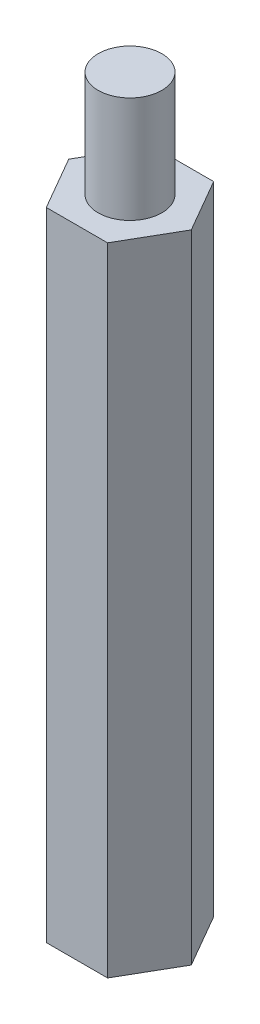
ISO-10303-21;
HEADER;
FILE_DESCRIPTION(('STEP AP214'),'2;1');
FILE_NAME('part.step','',(''),(''),'','','');
FILE_SCHEMA(('AUTOMOTIVE_DESIGN { 1 0 10303 214 1 1 1 1 }'));
ENDSEC;
DATA;
#1=APPLICATION_CONTEXT('core data for automotive mechanical design processes');
#2=APPLICATION_PROTOCOL_DEFINITION('international standard','automotive_design',2000,#1);
#3=PRODUCT_CONTEXT('',#1,'mechanical');
#4=PRODUCT('Part','Part','',(#3));
#5=PRODUCT_RELATED_PRODUCT_CATEGORY('part','',(#4));
#6=PRODUCT_DEFINITION_FORMATION('','',#4);
#7=PRODUCT_DEFINITION_CONTEXT('part definition',#1,'design');
#8=PRODUCT_DEFINITION('design','',#6,#7);
#9=PRODUCT_DEFINITION_SHAPE('','',#8);
#10=(LENGTH_UNIT() NAMED_UNIT(*) SI_UNIT(.MILLI.,.METRE.));
#11=(NAMED_UNIT(*) PLANE_ANGLE_UNIT() SI_UNIT($,.RADIAN.));
#12=(NAMED_UNIT(*) SI_UNIT($,.STERADIAN.) SOLID_ANGLE_UNIT());
#13=UNCERTAINTY_MEASURE_WITH_UNIT(LENGTH_MEASURE(1.E-05),#10,'distance_accuracy_value','');
#14=(GEOMETRIC_REPRESENTATION_CONTEXT(3) GLOBAL_UNCERTAINTY_ASSIGNED_CONTEXT((#13)) GLOBAL_UNIT_ASSIGNED_CONTEXT((#10,
#11,#12)) REPRESENTATION_CONTEXT('',''));
#15=CARTESIAN_POINT('',(0.,0.,0.));
#16=DIRECTION('',(0.,0.,1.));
#17=DIRECTION('',(1.,0.,0.));
#18=AXIS2_PLACEMENT_3D('',#15,#16,#17);
#19=CARTESIAN_POINT('',(1.44337567297409,30.,2.49999999999997));
#20=DIRECTION('',(-0.866025403784442,0.,-0.499999999999995));
#21=DIRECTION('',(-0.499999999999995,0.,0.866025403784442));
#22=AXIS2_PLACEMENT_3D('',#19,#20,#21);
#23=PLANE('',#22);
#24=DIRECTION('',(0.499999999999995,0.,-0.866025403784442));
#25=VECTOR('',#24,1.);
#26=CARTESIAN_POINT('',(1.44337567297409,0.,2.49999999999997));
#27=LINE('',#26,#25);
#28=CARTESIAN_POINT('',(1.44337567297409,0.,2.49999999999997));
#29=VERTEX_POINT('',#28);
#30=CARTESIAN_POINT('',(2.88675134594812,0.,0.));
#31=VERTEX_POINT('',#30);
#32=EDGE_CURVE('E118',#29,#31,#27,.T.);
#33=ORIENTED_EDGE('',*,*,#32,.T.);
#34=DIRECTION('',(0.,-1.,0.));
#35=VECTOR('',#34,1.);
#36=CARTESIAN_POINT('',(2.88675134594812,30.,0.));
#37=LINE('',#36,#35);
#38=CARTESIAN_POINT('',(2.88675134594812,30.,0.));
#39=VERTEX_POINT('',#38);
#40=EDGE_CURVE('E35',#39,#31,#37,.T.);
#41=ORIENTED_EDGE('',*,*,#40,.F.);
#42=DIRECTION('',(0.499999999999995,0.,-0.866025403784442));
#43=VECTOR('',#42,1.);
#44=CARTESIAN_POINT('',(1.44337567297409,30.,2.49999999999997));
#45=LINE('',#44,#43);
#46=CARTESIAN_POINT('',(1.44337567297409,30.,2.49999999999997));
#47=VERTEX_POINT('',#46);
#48=EDGE_CURVE('E129',#47,#39,#45,.T.);
#49=ORIENTED_EDGE('',*,*,#48,.F.);
#50=DIRECTION('',(0.,-1.,0.));
#51=VECTOR('',#50,1.);
#52=CARTESIAN_POINT('',(1.44337567297409,30.,2.49999999999997));
#53=LINE('',#52,#51);
#54=EDGE_CURVE('E114',#47,#29,#53,.T.);
#55=ORIENTED_EDGE('',*,*,#54,.T.);
#56=EDGE_LOOP('',(#33,#41,#49,#55));
#57=FACE_BOUND('',#56,.T.);
#58=ADVANCED_FACE('F32',(#57),#23,.F.);
#59=CARTESIAN_POINT('',(2.88675134594812,30.,0.));
#60=DIRECTION('',(-0.866025403784438,0.,0.500000000000001));
#61=DIRECTION('',(0.500000000000001,0.,0.866025403784438));
#62=AXIS2_PLACEMENT_3D('',#59,#60,#61);
#63=PLANE('',#62);
#64=DIRECTION('',(-0.500000000000001,0.,-0.866025403784438));
#65=VECTOR('',#64,1.);
#66=CARTESIAN_POINT('',(2.88675134594812,0.,0.));
#67=LINE('',#66,#65);
#68=CARTESIAN_POINT('',(1.44337567297405,0.,-2.49999999999999));
#69=VERTEX_POINT('',#68);
#70=EDGE_CURVE('E121',#31,#69,#67,.T.);
#71=ORIENTED_EDGE('',*,*,#70,.T.);
#72=DIRECTION('',(0.,-1.,0.));
#73=VECTOR('',#72,1.);
#74=CARTESIAN_POINT('',(1.44337567297405,30.,-2.49999999999999));
#75=LINE('',#74,#73);
#76=CARTESIAN_POINT('',(1.44337567297405,30.,-2.49999999999999));
#77=VERTEX_POINT('',#76);
#78=EDGE_CURVE('E132',#77,#69,#75,.T.);
#79=ORIENTED_EDGE('',*,*,#78,.F.);
#80=DIRECTION('',(-0.500000000000001,0.,-0.866025403784438));
#81=VECTOR('',#80,1.);
#82=CARTESIAN_POINT('',(2.88675134594812,30.,0.));
#83=LINE('',#82,#81);
#84=EDGE_CURVE('E87',#39,#77,#83,.T.);
#85=ORIENTED_EDGE('',*,*,#84,.F.);
#86=ORIENTED_EDGE('',*,*,#40,.T.);
#87=EDGE_LOOP('',(#71,#79,#85,#86));
#88=FACE_BOUND('',#87,.T.);
#89=ADVANCED_FACE('F137',(#88),#63,.F.);
#90=CARTESIAN_POINT('',(1.44337567297405,30.,-2.49999999999999));
#91=DIRECTION('',(0.,0.,1.));
#92=DIRECTION('',(1.,0.,0.));
#93=AXIS2_PLACEMENT_3D('',#90,#91,#92);
#94=PLANE('',#93);
#95=DIRECTION('',(-1.,0.,0.));
#96=VECTOR('',#95,1.);
#97=CARTESIAN_POINT('',(1.44337567297405,0.,-2.49999999999999));
#98=LINE('',#97,#96);
#99=CARTESIAN_POINT('',(-1.44337567297407,0.,-2.49999999999998));
#100=VERTEX_POINT('',#99);
#101=EDGE_CURVE('E124',#69,#100,#98,.T.);
#102=ORIENTED_EDGE('',*,*,#101,.T.);
#103=DIRECTION('',(0.,-1.,0.));
#104=VECTOR('',#103,1.);
#105=CARTESIAN_POINT('',(-1.44337567297407,30.,-2.49999999999998));
#106=LINE('',#105,#104);
#107=CARTESIAN_POINT('',(-1.44337567297407,30.,-2.49999999999998));
#108=VERTEX_POINT('',#107);
#109=EDGE_CURVE('E109',#108,#100,#106,.T.);
#110=ORIENTED_EDGE('',*,*,#109,.F.);
#111=DIRECTION('',(-1.,0.,0.));
#112=VECTOR('',#111,1.);
#113=CARTESIAN_POINT('',(1.44337567297405,30.,-2.49999999999999));
#114=LINE('',#113,#112);
#115=EDGE_CURVE('E100',#77,#108,#114,.T.);
#116=ORIENTED_EDGE('',*,*,#115,.F.);
#117=ORIENTED_EDGE('',*,*,#78,.T.);
#118=EDGE_LOOP('',(#102,#110,#116,#117));
#119=FACE_BOUND('',#118,.T.);
#120=ADVANCED_FACE('F143',(#119),#94,.F.);
#121=CARTESIAN_POINT('',(-1.44337567297407,30.,-2.49999999999998));
#122=DIRECTION('',(0.866025403784441,0.,0.499999999999995));
#123=DIRECTION('',(0.499999999999995,0.,-0.866025403784442));
#124=AXIS2_PLACEMENT_3D('',#121,#122,#123);
#125=PLANE('',#124);
#126=DIRECTION('',(-0.499999999999995,0.,0.866025403784442));
#127=VECTOR('',#126,1.);
#128=CARTESIAN_POINT('',(-1.44337567297407,0.,-2.49999999999998));
#129=LINE('',#128,#127);
#130=CARTESIAN_POINT('',(-2.88675134594812,0.,0.));
#131=VERTEX_POINT('',#130);
#132=EDGE_CURVE('E108',#100,#131,#129,.T.);
#133=ORIENTED_EDGE('',*,*,#132,.T.);
#134=DIRECTION('',(0.,-1.,0.));
#135=VECTOR('',#134,1.);
#136=CARTESIAN_POINT('',(-2.88675134594812,30.,0.));
#137=LINE('',#136,#135);
#138=CARTESIAN_POINT('',(-2.88675134594812,30.,0.));
#139=VERTEX_POINT('',#138);
#140=EDGE_CURVE('E105',#139,#131,#137,.T.);
#141=ORIENTED_EDGE('',*,*,#140,.F.);
#142=DIRECTION('',(-0.499999999999995,0.,0.866025403784442));
#143=VECTOR('',#142,1.);
#144=CARTESIAN_POINT('',(-1.44337567297407,30.,-2.49999999999998));
#145=LINE('',#144,#143);
#146=EDGE_CURVE('E94',#108,#139,#145,.T.);
#147=ORIENTED_EDGE('',*,*,#146,.F.);
#148=ORIENTED_EDGE('',*,*,#109,.T.);
#149=EDGE_LOOP('',(#133,#141,#147,#148));
#150=FACE_BOUND('',#149,.T.);
#151=ADVANCED_FACE('F106',(#150),#125,.F.);
#152=CARTESIAN_POINT('',(-2.88675134594812,30.,0.));
#153=DIRECTION('',(0.866025403784435,0.,-0.500000000000007));
#154=DIRECTION('',(-0.500000000000007,0.,-0.866025403784435));
#155=AXIS2_PLACEMENT_3D('',#152,#153,#154);
#156=PLANE('',#155);
#157=DIRECTION('',(0.500000000000007,0.,0.866025403784435));
#158=VECTOR('',#157,1.);
#159=CARTESIAN_POINT('',(-2.88675134594812,0.,0.));
#160=LINE('',#159,#158);
#161=CARTESIAN_POINT('',(-1.44337567297404,0.,2.5));
#162=VERTEX_POINT('',#161);
#163=EDGE_CURVE('E72',#131,#162,#160,.T.);
#164=ORIENTED_EDGE('',*,*,#163,.T.);
#165=DIRECTION('',(0.,-1.,0.));
#166=VECTOR('',#165,1.);
#167=CARTESIAN_POINT('',(-1.44337567297404,30.,2.5));
#168=LINE('',#167,#166);
#169=CARTESIAN_POINT('',(-1.44337567297404,30.,2.5));
#170=VERTEX_POINT('',#169);
#171=EDGE_CURVE('E110',#170,#162,#168,.T.);
#172=ORIENTED_EDGE('',*,*,#171,.F.);
#173=DIRECTION('',(0.500000000000007,0.,0.866025403784435));
#174=VECTOR('',#173,1.);
#175=CARTESIAN_POINT('',(-2.88675134594812,30.,0.));
#176=LINE('',#175,#174);
#177=EDGE_CURVE('E98',#139,#170,#176,.T.);
#178=ORIENTED_EDGE('',*,*,#177,.F.);
#179=ORIENTED_EDGE('',*,*,#140,.T.);
#180=EDGE_LOOP('',(#164,#172,#178,#179));
#181=FACE_BOUND('',#180,.T.);
#182=ADVANCED_FACE('F112',(#181),#156,.F.);
#183=CARTESIAN_POINT('',(-1.44337567297404,30.,2.5));
#184=DIRECTION('',(0.,0.,-1.));
#185=DIRECTION('',(-1.,0.,0.));
#186=AXIS2_PLACEMENT_3D('',#183,#184,#185);
#187=PLANE('',#186);
#188=DIRECTION('',(1.,0.,0.));
#189=VECTOR('',#188,1.);
#190=CARTESIAN_POINT('',(-1.44337567297404,0.,2.5));
#191=LINE('',#190,#189);
#192=EDGE_CURVE('E78',#162,#29,#191,.T.);
#193=ORIENTED_EDGE('',*,*,#192,.T.);
#194=ORIENTED_EDGE('',*,*,#54,.F.);
#195=DIRECTION('',(1.,0.,0.));
#196=VECTOR('',#195,1.);
#197=CARTESIAN_POINT('',(-1.44337567297404,30.,2.5));
#198=LINE('',#197,#196);
#199=EDGE_CURVE('E49',#170,#47,#198,.T.);
#200=ORIENTED_EDGE('',*,*,#199,.F.);
#201=ORIENTED_EDGE('',*,*,#171,.T.);
#202=EDGE_LOOP('',(#193,#194,#200,#201));
#203=FACE_BOUND('',#202,.T.);
#204=ADVANCED_FACE('F174',(#203),#187,.F.);
#205=CARTESIAN_POINT('',(0.,30.,0.));
#206=DIRECTION('',(0.,1.,0.));
#207=DIRECTION('',(0.,0.,1.));
#208=AXIS2_PLACEMENT_3D('',#205,#206,#207);
#209=PLANE('',#208);
#210=CARTESIAN_POINT('',(0.,30.,0.));
#211=DIRECTION('',(0.,1.,0.));
#212=DIRECTION('',(0.,0.,1.));
#213=AXIS2_PLACEMENT_3D('',#210,#211,#212);
#214=CIRCLE('',#213,1.5);
#215=CARTESIAN_POINT('',(0.,30.,1.5));
#216=VERTEX_POINT('',#215);
#217=EDGE_CURVE('E11',#216,#216,#214,.T.);
#218=ORIENTED_EDGE('',*,*,#217,.F.);
#219=EDGE_LOOP('',(#218));
#220=FACE_BOUND('',#219,.T.);
#221=ORIENTED_EDGE('',*,*,#48,.T.);
#222=ORIENTED_EDGE('',*,*,#84,.T.);
#223=ORIENTED_EDGE('',*,*,#115,.T.);
#224=ORIENTED_EDGE('',*,*,#146,.T.);
#225=ORIENTED_EDGE('',*,*,#177,.T.);
#226=ORIENTED_EDGE('',*,*,#199,.T.);
#227=EDGE_LOOP('',(#221,#222,#223,#224,#225,#226));
#228=FACE_BOUND('',#227,.T.);
#229=ADVANCED_FACE('F96',(#220,#228),#209,.T.);
#230=CARTESIAN_POINT('',(0.,0.,0.));
#231=DIRECTION('',(0.,1.,0.));
#232=DIRECTION('',(0.,0.,1.));
#233=AXIS2_PLACEMENT_3D('',#230,#231,#232);
#234=PLANE('',#233);
#235=CARTESIAN_POINT('',(0.,0.,0.));
#236=DIRECTION('',(0.,-1.,0.));
#237=DIRECTION('',(0.,0.,-1.));
#238=AXIS2_PLACEMENT_3D('',#235,#236,#237);
#239=CIRCLE('',#238,1.5);
#240=CARTESIAN_POINT('',(0.,0.,-1.5));
#241=VERTEX_POINT('',#240);
#242=EDGE_CURVE('E150',#241,#241,#239,.T.);
#243=ORIENTED_EDGE('',*,*,#242,.F.);
#244=EDGE_LOOP('',(#243));
#245=FACE_BOUND('',#244,.T.);
#246=ORIENTED_EDGE('',*,*,#32,.F.);
#247=ORIENTED_EDGE('',*,*,#192,.F.);
#248=ORIENTED_EDGE('',*,*,#163,.F.);
#249=ORIENTED_EDGE('',*,*,#132,.F.);
#250=ORIENTED_EDGE('',*,*,#101,.F.);
#251=ORIENTED_EDGE('',*,*,#70,.F.);
#252=EDGE_LOOP('',(#246,#247,#248,#249,#250,#251));
#253=FACE_BOUND('',#252,.T.);
#254=ADVANCED_FACE('F142',(#245,#253),#234,.F.);
#255=CARTESIAN_POINT('',(0.,35.,0.));
#256=DIRECTION('',(0.,-1.,0.));
#257=DIRECTION('',(0.,0.,-1.));
#258=AXIS2_PLACEMENT_3D('',#255,#256,#257);
#259=CYLINDRICAL_SURFACE('',#258,1.5);
#260=CARTESIAN_POINT('',(0.,35.,0.));
#261=DIRECTION('',(0.,1.,0.));
#262=DIRECTION('',(0.,0.,1.));
#263=AXIS2_PLACEMENT_3D('',#260,#261,#262);
#264=CIRCLE('',#263,1.5);
#265=CARTESIAN_POINT('',(0.,35.,1.5));
#266=VERTEX_POINT('',#265);
#267=EDGE_CURVE('E122',#266,#266,#264,.T.);
#268=ORIENTED_EDGE('',*,*,#267,.F.);
#269=EDGE_LOOP('',(#268));
#270=FACE_BOUND('',#269,.T.);
#271=ORIENTED_EDGE('',*,*,#217,.T.);
#272=EDGE_LOOP('',(#271));
#273=FACE_BOUND('',#272,.T.);
#274=ADVANCED_FACE('F166',(#270,#273),#259,.T.);
#275=CARTESIAN_POINT('',(0.,35.,0.));
#276=DIRECTION('',(0.,1.,0.));
#277=DIRECTION('',(0.,0.,1.));
#278=AXIS2_PLACEMENT_3D('',#275,#276,#277);
#279=PLANE('',#278);
#280=ORIENTED_EDGE('',*,*,#267,.T.);
#281=EDGE_LOOP('',(#280));
#282=FACE_BOUND('',#281,.T.);
#283=ADVANCED_FACE('F161',(#282),#279,.T.);
#284=CARTESIAN_POINT('',(0.,5.,0.));
#285=DIRECTION('',(0.,-1.,0.));
#286=DIRECTION('',(0.,0.,-1.));
#287=AXIS2_PLACEMENT_3D('',#284,#285,#286);
#288=CYLINDRICAL_SURFACE('',#287,1.5);
#289=CARTESIAN_POINT('',(0.,5.,0.));
#290=DIRECTION('',(0.,-1.,0.));
#291=DIRECTION('',(0.,0.,-1.));
#292=AXIS2_PLACEMENT_3D('',#289,#290,#291);
#293=CIRCLE('',#292,1.5);
#294=CARTESIAN_POINT('',(0.,5.,-1.5));
#295=VERTEX_POINT('',#294);
#296=EDGE_CURVE('E149',#295,#295,#293,.T.);
#297=ORIENTED_EDGE('',*,*,#296,.F.);
#298=EDGE_LOOP('',(#297));
#299=FACE_BOUND('',#298,.T.);
#300=ORIENTED_EDGE('',*,*,#242,.T.);
#301=EDGE_LOOP('',(#300));
#302=FACE_BOUND('',#301,.T.);
#303=ADVANCED_FACE('F158',(#299,#302),#288,.F.);
#304=CARTESIAN_POINT('',(0.,5.,0.));
#305=DIRECTION('',(0.,-1.,0.));
#306=DIRECTION('',(0.,0.,-1.));
#307=AXIS2_PLACEMENT_3D('',#304,#305,#306);
#308=PLANE('',#307);
#309=ORIENTED_EDGE('',*,*,#296,.T.);
#310=EDGE_LOOP('',(#309));
#311=FACE_BOUND('',#310,.T.);
#312=ADVANCED_FACE('F156',(#311),#308,.T.);
#313=CLOSED_SHELL('',(#58,#89,#120,#151,#182,#204,#229,#254,#274,#283,#303,#312));
#314=MANIFOLD_SOLID_BREP('B2',#313);
#315=ADVANCED_BREP_SHAPE_REPRESENTATION('',(#18,#314),#14);
#316=SHAPE_DEFINITION_REPRESENTATION(#9,#315);
ENDSEC;
END-ISO-10303-21;
